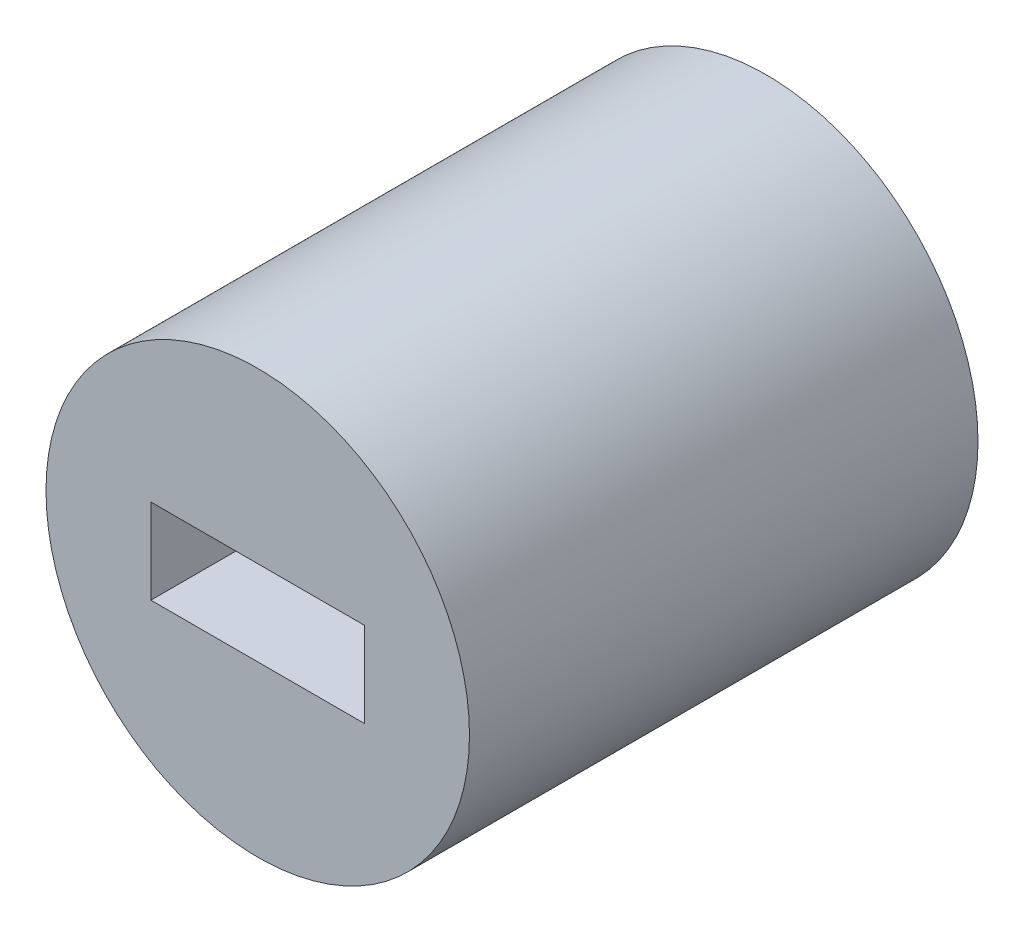
ISO-10303-21;
HEADER;
FILE_DESCRIPTION(('STEP AP214'),'2;1');
FILE_NAME('part.step','',(''),(''),'','','');
FILE_SCHEMA(('AUTOMOTIVE_DESIGN { 1 0 10303 214 1 1 1 1 }'));
ENDSEC;
DATA;
#1=APPLICATION_CONTEXT('core data for automotive mechanical design processes');
#2=APPLICATION_PROTOCOL_DEFINITION('international standard','automotive_design',2000,#1);
#3=PRODUCT_CONTEXT('',#1,'mechanical');
#4=PRODUCT('Part','Part','',(#3));
#5=PRODUCT_RELATED_PRODUCT_CATEGORY('part','',(#4));
#6=PRODUCT_DEFINITION_FORMATION('','',#4);
#7=PRODUCT_DEFINITION_CONTEXT('part definition',#1,'design');
#8=PRODUCT_DEFINITION('design','',#6,#7);
#9=PRODUCT_DEFINITION_SHAPE('','',#8);
#10=(LENGTH_UNIT() NAMED_UNIT(*) SI_UNIT(.MILLI.,.METRE.));
#11=(NAMED_UNIT(*) PLANE_ANGLE_UNIT() SI_UNIT($,.RADIAN.));
#12=(NAMED_UNIT(*) SI_UNIT($,.STERADIAN.) SOLID_ANGLE_UNIT());
#13=UNCERTAINTY_MEASURE_WITH_UNIT(LENGTH_MEASURE(1.E-05),#10,'distance_accuracy_value','');
#14=(GEOMETRIC_REPRESENTATION_CONTEXT(3) GLOBAL_UNCERTAINTY_ASSIGNED_CONTEXT((#13)) GLOBAL_UNIT_ASSIGNED_CONTEXT((#10,
#11,#12)) REPRESENTATION_CONTEXT('',''));
#15=CARTESIAN_POINT('',(0.,0.,0.));
#16=DIRECTION('',(0.,0.,1.));
#17=DIRECTION('',(1.,0.,0.));
#18=AXIS2_PLACEMENT_3D('',#15,#16,#17);
#19=CARTESIAN_POINT('',(-0.64100581951225,0.,3.05));
#20=DIRECTION('',(1.,0.,0.));
#21=DIRECTION('',(0.,1.,0.));
#22=AXIS2_PLACEMENT_3D('',#19,#20,#21);
#23=PLANE('',#22);
#24=DIRECTION('',(0.,1.,0.));
#25=VECTOR('',#24,1.);
#26=CARTESIAN_POINT('',(-0.64100581951225,0.,1.55));
#27=LINE('',#26,#25);
#28=CARTESIAN_POINT('',(-0.64100581951225,0.255,1.55));
#29=VERTEX_POINT('',#28);
#30=CARTESIAN_POINT('',(-0.64100581951225,-0.255,1.55));
#31=VERTEX_POINT('',#30);
#32=EDGE_CURVE('E114',#29,#31,#27,.F.);
#33=ORIENTED_EDGE('',*,*,#32,.F.);
#34=DIRECTION('',(0.,0.,1.));
#35=VECTOR('',#34,1.);
#36=CARTESIAN_POINT('',(-0.64100581951225,0.255,3.05));
#37=LINE('',#36,#35);
#38=CARTESIAN_POINT('',(-0.64100581951225,0.255,3.05));
#39=VERTEX_POINT('',#38);
#40=EDGE_CURVE('E122',#39,#29,#37,.F.);
#41=ORIENTED_EDGE('',*,*,#40,.F.);
#42=DIRECTION('',(0.,1.,0.));
#43=VECTOR('',#42,1.);
#44=CARTESIAN_POINT('',(-0.64100581951225,0.,3.05));
#45=LINE('',#44,#43);
#46=CARTESIAN_POINT('',(-0.64100581951225,-0.255,3.05));
#47=VERTEX_POINT('',#46);
#48=EDGE_CURVE('E32',#39,#47,#45,.F.);
#49=ORIENTED_EDGE('',*,*,#48,.T.);
#50=DIRECTION('',(0.,0.,1.));
#51=VECTOR('',#50,1.);
#52=CARTESIAN_POINT('',(-0.64100581951225,-0.255,3.05));
#53=LINE('',#52,#51);
#54=EDGE_CURVE('E119',#31,#47,#53,.T.);
#55=ORIENTED_EDGE('',*,*,#54,.F.);
#56=EDGE_LOOP('',(#33,#41,#49,#55));
#57=FACE_BOUND('',#56,.T.);
#58=ADVANCED_FACE('F16',(#57),#23,.T.);
#59=CARTESIAN_POINT('',(0.,0.,1.55));
#60=DIRECTION('',(0.,0.,1.));
#61=DIRECTION('',(1.,0.,0.));
#62=AXIS2_PLACEMENT_3D('',#59,#60,#61);
#63=PLANE('',#62);
#64=DIRECTION('',(-1.,0.,0.));
#65=VECTOR('',#64,1.);
#66=CARTESIAN_POINT('',(0.528723609904574,-0.255,1.55));
#67=LINE('',#66,#65);
#68=CARTESIAN_POINT('',(-0.416441400296898,-0.255,1.55));
#69=VERTEX_POINT('',#68);
#70=EDGE_CURVE('E127',#69,#31,#67,.T.);
#71=ORIENTED_EDGE('',*,*,#70,.F.);
#72=DIRECTION('',(0.,-1.,0.));
#73=VECTOR('',#72,1.);
#74=CARTESIAN_POINT('',(-0.416441400296898,0.,1.55));
#75=LINE('',#74,#73);
#76=CARTESIAN_POINT('',(-0.416441400296898,0.255,1.55));
#77=VERTEX_POINT('',#76);
#78=EDGE_CURVE('E112',#69,#77,#75,.F.);
#79=ORIENTED_EDGE('',*,*,#78,.T.);
#80=DIRECTION('',(1.,0.,0.));
#81=VECTOR('',#80,1.);
#82=CARTESIAN_POINT('',(-0.528723609904574,0.255,1.55));
#83=LINE('',#82,#81);
#84=EDGE_CURVE('E148',#29,#77,#83,.T.);
#85=ORIENTED_EDGE('',*,*,#84,.F.);
#86=ORIENTED_EDGE('',*,*,#32,.T.);
#87=EDGE_LOOP('',(#71,#79,#85,#86));
#88=FACE_BOUND('',#87,.T.);
#89=ADVANCED_FACE('F159',(#88),#63,.T.);
#90=CARTESIAN_POINT('',(-0.416441400296898,0.,3.05));
#91=DIRECTION('',(-1.,0.,0.));
#92=DIRECTION('',(0.,-1.,0.));
#93=AXIS2_PLACEMENT_3D('',#90,#91,#92);
#94=PLANE('',#93);
#95=DIRECTION('',(0.,0.,1.));
#96=VECTOR('',#95,1.);
#97=CARTESIAN_POINT('',(-0.416441400296898,0.255,3.05));
#98=LINE('',#97,#96);
#99=CARTESIAN_POINT('',(-0.416441400296898,0.255,0.));
#100=VERTEX_POINT('',#99);
#101=EDGE_CURVE('E145',#77,#100,#98,.F.);
#102=ORIENTED_EDGE('',*,*,#101,.F.);
#103=ORIENTED_EDGE('',*,*,#78,.F.);
#104=DIRECTION('',(0.,0.,1.));
#105=VECTOR('',#104,1.);
#106=CARTESIAN_POINT('',(-0.416441400296898,-0.255,3.05));
#107=LINE('',#106,#105);
#108=CARTESIAN_POINT('',(-0.416441400296898,-0.255,0.));
#109=VERTEX_POINT('',#108);
#110=EDGE_CURVE('E96',#109,#69,#107,.T.);
#111=ORIENTED_EDGE('',*,*,#110,.F.);
#112=DIRECTION('',(0.,-1.,0.));
#113=VECTOR('',#112,1.);
#114=CARTESIAN_POINT('',(-0.416441400296898,0.,0.));
#115=LINE('',#114,#113);
#116=EDGE_CURVE('E110',#100,#109,#115,.T.);
#117=ORIENTED_EDGE('',*,*,#116,.F.);
#118=EDGE_LOOP('',(#102,#103,#111,#117));
#119=FACE_BOUND('',#118,.T.);
#120=ADVANCED_FACE('F156',(#119),#94,.F.);
#121=CARTESIAN_POINT('',(0.416441400296898,0.,3.05));
#122=DIRECTION('',(1.,0.,0.));
#123=DIRECTION('',(0.,1.,0.));
#124=AXIS2_PLACEMENT_3D('',#121,#122,#123);
#125=PLANE('',#124);
#126=DIRECTION('',(0.,0.,1.));
#127=VECTOR('',#126,1.);
#128=CARTESIAN_POINT('',(0.416441400296898,-0.255,3.05));
#129=LINE('',#128,#127);
#130=CARTESIAN_POINT('',(0.416441400296898,-0.255,1.55));
#131=VERTEX_POINT('',#130);
#132=CARTESIAN_POINT('',(0.416441400296898,-0.255,0.));
#133=VERTEX_POINT('',#132);
#134=EDGE_CURVE('E91',#131,#133,#129,.F.);
#135=ORIENTED_EDGE('',*,*,#134,.F.);
#136=DIRECTION('',(0.,1.,0.));
#137=VECTOR('',#136,1.);
#138=CARTESIAN_POINT('',(0.416441400296898,0.,1.55));
#139=LINE('',#138,#137);
#140=CARTESIAN_POINT('',(0.416441400296898,0.255,1.55));
#141=VERTEX_POINT('',#140);
#142=EDGE_CURVE('E79',#141,#131,#139,.F.);
#143=ORIENTED_EDGE('',*,*,#142,.F.);
#144=DIRECTION('',(0.,0.,1.));
#145=VECTOR('',#144,1.);
#146=CARTESIAN_POINT('',(0.416441400296898,0.255,3.05));
#147=LINE('',#146,#145);
#148=CARTESIAN_POINT('',(0.416441400296898,0.255,0.));
#149=VERTEX_POINT('',#148);
#150=EDGE_CURVE('E143',#149,#141,#147,.T.);
#151=ORIENTED_EDGE('',*,*,#150,.F.);
#152=DIRECTION('',(0.,1.,0.));
#153=VECTOR('',#152,1.);
#154=CARTESIAN_POINT('',(0.416441400296898,0.,0.));
#155=LINE('',#154,#153);
#156=EDGE_CURVE('E88',#133,#149,#155,.T.);
#157=ORIENTED_EDGE('',*,*,#156,.F.);
#158=EDGE_LOOP('',(#135,#143,#151,#157));
#159=FACE_BOUND('',#158,.T.);
#160=ADVANCED_FACE('F92',(#159),#125,.F.);
#161=CARTESIAN_POINT('',(0.,0.,1.55));
#162=DIRECTION('',(0.,0.,1.));
#163=DIRECTION('',(1.,0.,0.));
#164=AXIS2_PLACEMENT_3D('',#161,#162,#163);
#165=PLANE('',#164);
#166=ORIENTED_EDGE('',*,*,#142,.T.);
#167=DIRECTION('',(-1.,0.,0.));
#168=VECTOR('',#167,1.);
#169=CARTESIAN_POINT('',(0.528723609904574,-0.255,1.55));
#170=LINE('',#169,#168);
#171=CARTESIAN_POINT('',(0.64100581951225,-0.255,1.55));
#172=VERTEX_POINT('',#171);
#173=EDGE_CURVE('E76',#172,#131,#170,.T.);
#174=ORIENTED_EDGE('',*,*,#173,.F.);
#175=DIRECTION('',(0.,-1.,0.));
#176=VECTOR('',#175,1.);
#177=CARTESIAN_POINT('',(0.64100581951225,0.,1.55));
#178=LINE('',#177,#176);
#179=CARTESIAN_POINT('',(0.64100581951225,0.255,1.55));
#180=VERTEX_POINT('',#179);
#181=EDGE_CURVE('E87',#180,#172,#178,.T.);
#182=ORIENTED_EDGE('',*,*,#181,.F.);
#183=DIRECTION('',(1.,0.,0.));
#184=VECTOR('',#183,1.);
#185=CARTESIAN_POINT('',(-0.528723609904574,0.255,1.55));
#186=LINE('',#185,#184);
#187=EDGE_CURVE('E83',#141,#180,#186,.T.);
#188=ORIENTED_EDGE('',*,*,#187,.F.);
#189=EDGE_LOOP('',(#166,#174,#182,#188));
#190=FACE_BOUND('',#189,.T.);
#191=ADVANCED_FACE('F81',(#190),#165,.T.);
#192=CARTESIAN_POINT('',(0.64100581951225,0.,3.05));
#193=DIRECTION('',(-1.,0.,0.));
#194=DIRECTION('',(0.,-1.,0.));
#195=AXIS2_PLACEMENT_3D('',#192,#193,#194);
#196=PLANE('',#195);
#197=DIRECTION('',(0.,-1.,0.));
#198=VECTOR('',#197,1.);
#199=CARTESIAN_POINT('',(0.64100581951225,0.,3.05));
#200=LINE('',#199,#198);
#201=CARTESIAN_POINT('',(0.64100581951225,-0.255,3.05));
#202=VERTEX_POINT('',#201);
#203=CARTESIAN_POINT('',(0.64100581951225,0.255,3.05));
#204=VERTEX_POINT('',#203);
#205=EDGE_CURVE('E103',#202,#204,#200,.F.);
#206=ORIENTED_EDGE('',*,*,#205,.T.);
#207=DIRECTION('',(0.,0.,1.));
#208=VECTOR('',#207,1.);
#209=CARTESIAN_POINT('',(0.64100581951225,0.255,3.05));
#210=LINE('',#209,#208);
#211=EDGE_CURVE('E139',#180,#204,#210,.T.);
#212=ORIENTED_EDGE('',*,*,#211,.F.);
#213=ORIENTED_EDGE('',*,*,#181,.T.);
#214=DIRECTION('',(0.,0.,1.));
#215=VECTOR('',#214,1.);
#216=CARTESIAN_POINT('',(0.64100581951225,-0.255,3.05));
#217=LINE('',#216,#215);
#218=EDGE_CURVE('E102',#202,#172,#217,.F.);
#219=ORIENTED_EDGE('',*,*,#218,.F.);
#220=EDGE_LOOP('',(#206,#212,#213,#219));
#221=FACE_BOUND('',#220,.T.);
#222=ADVANCED_FACE('F164',(#221),#196,.T.);
#223=CARTESIAN_POINT('',(0.528723609904574,-0.255,3.05));
#224=DIRECTION('',(0.,1.,0.));
#225=DIRECTION('',(-1.,0.,0.));
#226=AXIS2_PLACEMENT_3D('',#223,#224,#225);
#227=PLANE('',#226);
#228=DIRECTION('',(1.,0.,0.));
#229=VECTOR('',#228,1.);
#230=CARTESIAN_POINT('',(0.,-0.255,3.05));
#231=LINE('',#230,#229);
#232=EDGE_CURVE('E124',#202,#47,#231,.F.);
#233=ORIENTED_EDGE('',*,*,#232,.F.);
#234=ORIENTED_EDGE('',*,*,#218,.T.);
#235=ORIENTED_EDGE('',*,*,#173,.T.);
#236=ORIENTED_EDGE('',*,*,#134,.T.);
#237=DIRECTION('',(1.,0.,0.));
#238=VECTOR('',#237,1.);
#239=CARTESIAN_POINT('',(0.,-0.255,0.));
#240=LINE('',#239,#238);
#241=EDGE_CURVE('E135',#133,#109,#240,.F.);
#242=ORIENTED_EDGE('',*,*,#241,.T.);
#243=ORIENTED_EDGE('',*,*,#110,.T.);
#244=ORIENTED_EDGE('',*,*,#70,.T.);
#245=ORIENTED_EDGE('',*,*,#54,.T.);
#246=EDGE_LOOP('',(#233,#234,#235,#236,#242,#243,#244,#245));
#247=FACE_BOUND('',#246,.T.);
#248=ADVANCED_FACE('F100',(#247),#227,.T.);
#249=CARTESIAN_POINT('',(-0.528723609904574,0.255,3.05));
#250=DIRECTION('',(0.,-1.,0.));
#251=DIRECTION('',(1.,0.,0.));
#252=AXIS2_PLACEMENT_3D('',#249,#250,#251);
#253=PLANE('',#252);
#254=ORIENTED_EDGE('',*,*,#187,.T.);
#255=ORIENTED_EDGE('',*,*,#211,.T.);
#256=DIRECTION('',(1.,0.,0.));
#257=VECTOR('',#256,1.);
#258=CARTESIAN_POINT('',(0.,0.255,3.05));
#259=LINE('',#258,#257);
#260=EDGE_CURVE('E130',#39,#204,#259,.T.);
#261=ORIENTED_EDGE('',*,*,#260,.F.);
#262=ORIENTED_EDGE('',*,*,#40,.T.);
#263=ORIENTED_EDGE('',*,*,#84,.T.);
#264=ORIENTED_EDGE('',*,*,#101,.T.);
#265=DIRECTION('',(1.,0.,0.));
#266=VECTOR('',#265,1.);
#267=CARTESIAN_POINT('',(0.,0.255,0.));
#268=LINE('',#267,#266);
#269=EDGE_CURVE('E131',#100,#149,#268,.T.);
#270=ORIENTED_EDGE('',*,*,#269,.T.);
#271=ORIENTED_EDGE('',*,*,#150,.T.);
#272=EDGE_LOOP('',(#254,#255,#261,#262,#263,#264,#270,#271));
#273=FACE_BOUND('',#272,.T.);
#274=ADVANCED_FACE('F161',(#273),#253,.T.);
#275=CARTESIAN_POINT('',(0.,0.,0.));
#276=DIRECTION('',(0.,0.,1.));
#277=DIRECTION('',(1.,0.,0.));
#278=AXIS2_PLACEMENT_3D('',#275,#276,#277);
#279=PLANE('',#278);
#280=CARTESIAN_POINT('',(0.,0.,0.));
#281=DIRECTION('',(0.,0.,1.));
#282=DIRECTION('',(1.,0.,0.));
#283=AXIS2_PLACEMENT_3D('',#280,#281,#282);
#284=CIRCLE('',#283,1.27);
#285=CARTESIAN_POINT('',(1.27,0.,0.));
#286=VERTEX_POINT('',#285);
#287=EDGE_CURVE('E19',#286,#286,#284,.T.);
#288=ORIENTED_EDGE('',*,*,#287,.F.);
#289=EDGE_LOOP('',(#288));
#290=FACE_BOUND('',#289,.T.);
#291=ORIENTED_EDGE('',*,*,#116,.T.);
#292=ORIENTED_EDGE('',*,*,#241,.F.);
#293=ORIENTED_EDGE('',*,*,#156,.T.);
#294=ORIENTED_EDGE('',*,*,#269,.F.);
#295=EDGE_LOOP('',(#291,#292,#293,#294));
#296=FACE_BOUND('',#295,.T.);
#297=ADVANCED_FACE('F183',(#290,#296),#279,.F.);
#298=CARTESIAN_POINT('',(0.,0.,3.05));
#299=DIRECTION('',(0.,0.,1.));
#300=DIRECTION('',(1.,0.,0.));
#301=AXIS2_PLACEMENT_3D('',#298,#299,#300);
#302=PLANE('',#301);
#303=CARTESIAN_POINT('',(0.,0.,3.05));
#304=DIRECTION('',(0.,0.,1.));
#305=DIRECTION('',(1.,0.,0.));
#306=AXIS2_PLACEMENT_3D('',#303,#304,#305);
#307=CIRCLE('',#306,1.27);
#308=CARTESIAN_POINT('',(1.27,0.,3.05));
#309=VERTEX_POINT('',#308);
#310=EDGE_CURVE('E11',#309,#309,#307,.F.);
#311=ORIENTED_EDGE('',*,*,#310,.F.);
#312=EDGE_LOOP('',(#311));
#313=FACE_BOUND('',#312,.T.);
#314=ORIENTED_EDGE('',*,*,#48,.F.);
#315=ORIENTED_EDGE('',*,*,#260,.T.);
#316=ORIENTED_EDGE('',*,*,#205,.F.);
#317=ORIENTED_EDGE('',*,*,#232,.T.);
#318=EDGE_LOOP('',(#314,#315,#316,#317));
#319=FACE_BOUND('',#318,.T.);
#320=ADVANCED_FACE('F129',(#313,#319),#302,.T.);
#321=CARTESIAN_POINT('',(0.,0.,0.));
#322=DIRECTION('',(0.,0.,1.));
#323=DIRECTION('',(1.,0.,0.));
#324=AXIS2_PLACEMENT_3D('',#321,#322,#323);
#325=CYLINDRICAL_SURFACE('',#324,1.27);
#326=ORIENTED_EDGE('',*,*,#287,.T.);
#327=EDGE_LOOP('',(#326));
#328=FACE_BOUND('',#327,.T.);
#329=ORIENTED_EDGE('',*,*,#310,.T.);
#330=EDGE_LOOP('',(#329));
#331=FACE_BOUND('',#330,.T.);
#332=ADVANCED_FACE('F175',(#328,#331),#325,.T.);
#333=CLOSED_SHELL('',(#58,#89,#120,#160,#191,#222,#248,#274,#297,#320,#332));
#334=MANIFOLD_SOLID_BREP('B1',#333);
#335=ADVANCED_BREP_SHAPE_REPRESENTATION('',(#18,#334),#14);
#336=SHAPE_DEFINITION_REPRESENTATION(#9,#335);
ENDSEC;
END-ISO-10303-21;
